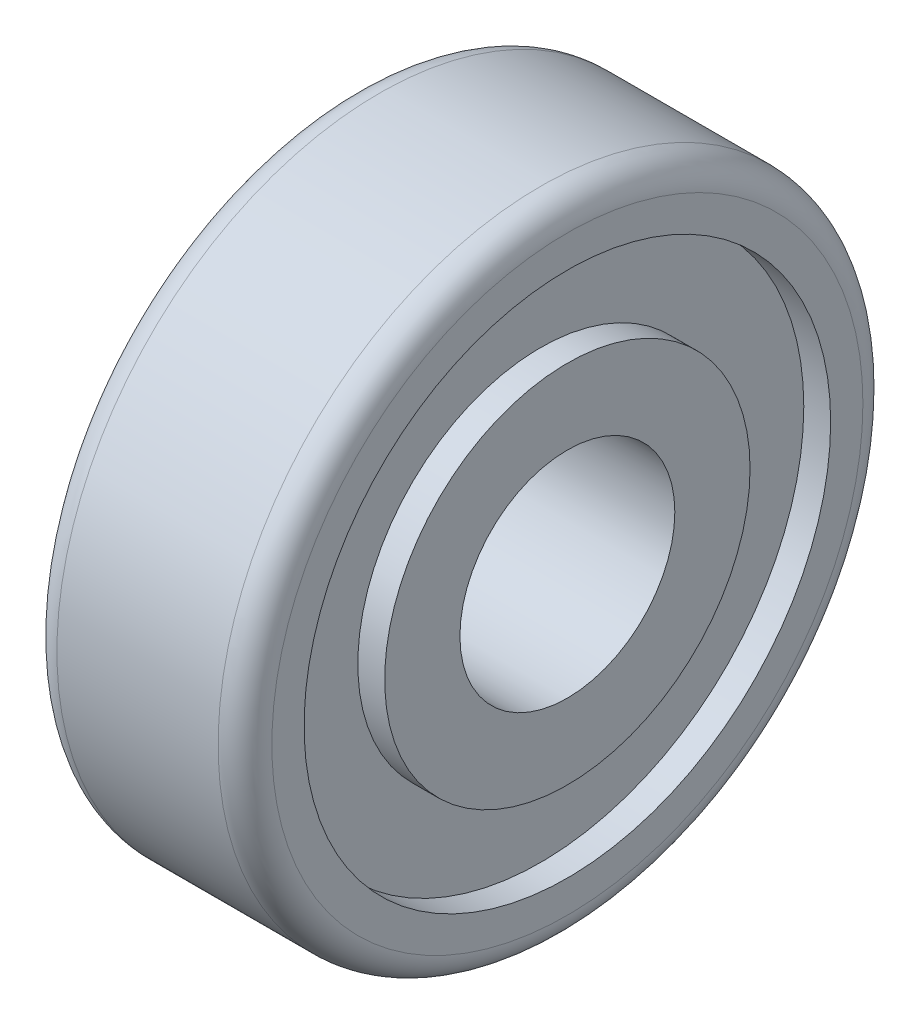
ISO-10303-21;
HEADER;
FILE_DESCRIPTION(('STEP AP214'),'2;1');
FILE_NAME('part.step','',(''),(''),'','','');
FILE_SCHEMA(('AUTOMOTIVE_DESIGN { 1 0 10303 214 1 1 1 1 }'));
ENDSEC;
DATA;
#1=APPLICATION_CONTEXT('core data for automotive mechanical design processes');
#2=APPLICATION_PROTOCOL_DEFINITION('international standard','automotive_design',2000,#1);
#3=PRODUCT_CONTEXT('',#1,'mechanical');
#4=PRODUCT('Part','Part','',(#3));
#5=PRODUCT_RELATED_PRODUCT_CATEGORY('part','',(#4));
#6=PRODUCT_DEFINITION_FORMATION('','',#4);
#7=PRODUCT_DEFINITION_CONTEXT('part definition',#1,'design');
#8=PRODUCT_DEFINITION('design','',#6,#7);
#9=PRODUCT_DEFINITION_SHAPE('','',#8);
#10=(LENGTH_UNIT() NAMED_UNIT(*) SI_UNIT(.MILLI.,.METRE.));
#11=(NAMED_UNIT(*) PLANE_ANGLE_UNIT() SI_UNIT($,.RADIAN.));
#12=(NAMED_UNIT(*) SI_UNIT($,.STERADIAN.) SOLID_ANGLE_UNIT());
#13=UNCERTAINTY_MEASURE_WITH_UNIT(LENGTH_MEASURE(1.E-05),#10,'distance_accuracy_value','');
#14=(GEOMETRIC_REPRESENTATION_CONTEXT(3) GLOBAL_UNCERTAINTY_ASSIGNED_CONTEXT((#13)) GLOBAL_UNIT_ASSIGNED_CONTEXT((#10,
#11,#12)) REPRESENTATION_CONTEXT('',''));
#15=CARTESIAN_POINT('',(0.,0.,0.));
#16=DIRECTION('',(0.,0.,1.));
#17=DIRECTION('',(1.,0.,0.));
#18=AXIS2_PLACEMENT_3D('',#15,#16,#17);
#19=CARTESIAN_POINT('',(0.,0.,0.));
#20=DIRECTION('',(1.,0.,0.));
#21=DIRECTION('',(0.,0.,-1.));
#22=AXIS2_PLACEMENT_3D('',#19,#20,#21);
#23=PLANE('',#22);
#24=CARTESIAN_POINT('',(0.,0.,0.));
#25=DIRECTION('',(1.,0.,0.));
#26=DIRECTION('',(0.,0.,-1.));
#27=AXIS2_PLACEMENT_3D('',#24,#25,#26);
#28=CIRCLE('',#27,2.);
#29=CARTESIAN_POINT('',(0.,0.,-2.));
#30=VERTEX_POINT('',#29);
#31=EDGE_CURVE('E52',#30,#30,#28,.T.);
#32=ORIENTED_EDGE('',*,*,#31,.T.);
#33=EDGE_LOOP('',(#32));
#34=FACE_BOUND('',#33,.T.);
#35=CARTESIAN_POINT('',(0.,0.,0.));
#36=DIRECTION('',(-1.,0.,0.));
#37=DIRECTION('',(0.,0.,1.));
#38=AXIS2_PLACEMENT_3D('',#35,#36,#37);
#39=CIRCLE('',#38,3.4);
#40=CARTESIAN_POINT('',(0.,0.,3.4));
#41=VERTEX_POINT('',#40);
#42=EDGE_CURVE('E76',#41,#41,#39,.T.);
#43=ORIENTED_EDGE('',*,*,#42,.T.);
#44=EDGE_LOOP('',(#43));
#45=FACE_BOUND('',#44,.T.);
#46=ADVANCED_FACE('F31',(#34,#45),#23,.F.);
#47=CARTESIAN_POINT('',(4.,0.,0.));
#48=DIRECTION('',(1.,0.,0.));
#49=DIRECTION('',(0.,0.,-1.));
#50=AXIS2_PLACEMENT_3D('',#47,#48,#49);
#51=PLANE('',#50);
#52=CARTESIAN_POINT('',(4.,0.,0.));
#53=DIRECTION('',(1.,0.,0.));
#54=DIRECTION('',(0.,0.,-1.));
#55=AXIS2_PLACEMENT_3D('',#52,#53,#54);
#56=CIRCLE('',#55,2.);
#57=CARTESIAN_POINT('',(4.,0.,-2.));
#58=VERTEX_POINT('',#57);
#59=EDGE_CURVE('E51',#58,#58,#56,.T.);
#60=ORIENTED_EDGE('',*,*,#59,.F.);
#61=EDGE_LOOP('',(#60));
#62=FACE_BOUND('',#61,.T.);
#63=CARTESIAN_POINT('',(4.,0.,0.));
#64=DIRECTION('',(1.,0.,0.));
#65=DIRECTION('',(0.,0.,-1.));
#66=AXIS2_PLACEMENT_3D('',#63,#64,#65);
#67=CIRCLE('',#66,3.4);
#68=CARTESIAN_POINT('',(4.,0.,-3.4));
#69=VERTEX_POINT('',#68);
#70=EDGE_CURVE('E64',#69,#69,#67,.T.);
#71=ORIENTED_EDGE('',*,*,#70,.T.);
#72=EDGE_LOOP('',(#71));
#73=FACE_BOUND('',#72,.T.);
#74=ADVANCED_FACE('F110',(#62,#73),#51,.T.);
#75=CARTESIAN_POINT('',(4.,0.,0.));
#76=DIRECTION('',(1.,0.,0.));
#77=DIRECTION('',(0.,0.,-1.));
#78=AXIS2_PLACEMENT_3D('',#75,#76,#77);
#79=CIRCLE('',#78,4.9);
#80=CARTESIAN_POINT('',(4.,0.,-4.9));
#81=VERTEX_POINT('',#80);
#82=EDGE_CURVE('E58',#81,#81,#79,.T.);
#83=ORIENTED_EDGE('',*,*,#82,.F.);
#84=EDGE_LOOP('',(#83));
#85=FACE_BOUND('',#84,.T.);
#86=CARTESIAN_POINT('',(4.,0.,0.));
#87=DIRECTION('',(1.,0.,0.));
#88=DIRECTION('',(0.,0.,-1.));
#89=AXIS2_PLACEMENT_3D('',#86,#87,#88);
#90=CIRCLE('',#89,5.5);
#91=CARTESIAN_POINT('',(4.,0.,-5.5));
#92=VERTEX_POINT('',#91);
#93=EDGE_CURVE('E10',#92,#92,#90,.T.);
#94=ORIENTED_EDGE('',*,*,#93,.T.);
#95=EDGE_LOOP('',(#94));
#96=FACE_BOUND('',#95,.T.);
#97=ADVANCED_FACE('F101',(#85,#96),#51,.T.);
#98=CARTESIAN_POINT('',(0.,0.,0.));
#99=DIRECTION('',(-1.,0.,0.));
#100=DIRECTION('',(0.,0.,1.));
#101=AXIS2_PLACEMENT_3D('',#98,#99,#100);
#102=CIRCLE('',#101,4.9);
#103=CARTESIAN_POINT('',(0.,0.,4.9));
#104=VERTEX_POINT('',#103);
#105=EDGE_CURVE('E70',#104,#104,#102,.T.);
#106=ORIENTED_EDGE('',*,*,#105,.F.);
#107=EDGE_LOOP('',(#106));
#108=FACE_BOUND('',#107,.T.);
#109=CARTESIAN_POINT('',(0.,0.,0.));
#110=DIRECTION('',(1.,0.,0.));
#111=DIRECTION('',(0.,0.,-1.));
#112=AXIS2_PLACEMENT_3D('',#109,#110,#111);
#113=CIRCLE('',#112,5.5);
#114=CARTESIAN_POINT('',(0.,0.,-5.5));
#115=VERTEX_POINT('',#114);
#116=EDGE_CURVE('E38',#115,#115,#113,.F.);
#117=ORIENTED_EDGE('',*,*,#116,.T.);
#118=EDGE_LOOP('',(#117));
#119=FACE_BOUND('',#118,.T.);
#120=ADVANCED_FACE('F98',(#108,#119),#23,.F.);
#121=CARTESIAN_POINT('',(4.,0.,0.));
#122=DIRECTION('',(-1.,0.,0.));
#123=DIRECTION('',(0.,0.,1.));
#124=AXIS2_PLACEMENT_3D('',#121,#122,#123);
#125=CYLINDRICAL_SURFACE('',#124,6.);
#126=CARTESIAN_POINT('',(0.5,0.,0.));
#127=DIRECTION('',(1.,0.,0.));
#128=DIRECTION('',(0.,0.,-1.));
#129=AXIS2_PLACEMENT_3D('',#126,#127,#128);
#130=CIRCLE('',#129,6.);
#131=CARTESIAN_POINT('',(0.5,0.,-6.));
#132=VERTEX_POINT('',#131);
#133=EDGE_CURVE('E42',#132,#132,#130,.T.);
#134=ORIENTED_EDGE('',*,*,#133,.T.);
#135=EDGE_LOOP('',(#134));
#136=FACE_BOUND('',#135,.T.);
#137=CARTESIAN_POINT('',(3.5,0.,0.));
#138=DIRECTION('',(1.,0.,0.));
#139=DIRECTION('',(0.,0.,-1.));
#140=AXIS2_PLACEMENT_3D('',#137,#138,#139);
#141=CIRCLE('',#140,6.);
#142=CARTESIAN_POINT('',(3.5,0.,-6.));
#143=VERTEX_POINT('',#142);
#144=EDGE_CURVE('E46',#143,#143,#141,.F.);
#145=ORIENTED_EDGE('',*,*,#144,.T.);
#146=EDGE_LOOP('',(#145));
#147=FACE_BOUND('',#146,.T.);
#148=ADVANCED_FACE('F100',(#136,#147),#125,.T.);
#149=CARTESIAN_POINT('',(4.,0.,0.));
#150=DIRECTION('',(-1.,0.,0.));
#151=DIRECTION('',(0.,0.,1.));
#152=AXIS2_PLACEMENT_3D('',#149,#150,#151);
#153=CYLINDRICAL_SURFACE('',#152,2.);
#154=ORIENTED_EDGE('',*,*,#59,.T.);
#155=EDGE_LOOP('',(#154));
#156=FACE_BOUND('',#155,.T.);
#157=ORIENTED_EDGE('',*,*,#31,.F.);
#158=EDGE_LOOP('',(#157));
#159=FACE_BOUND('',#158,.T.);
#160=ADVANCED_FACE('F107',(#156,#159),#153,.F.);
#161=CARTESIAN_POINT('',(0.5,0.,0.));
#162=DIRECTION('',(1.,0.,0.));
#163=DIRECTION('',(0.,0.,-1.));
#164=AXIS2_PLACEMENT_3D('',#161,#162,#163);
#165=TOROIDAL_SURFACE('',#164,5.5,0.5);
#166=ORIENTED_EDGE('',*,*,#116,.F.);
#167=EDGE_LOOP('',(#166));
#168=FACE_BOUND('',#167,.T.);
#169=ORIENTED_EDGE('',*,*,#133,.F.);
#170=EDGE_LOOP('',(#169));
#171=FACE_BOUND('',#170,.T.);
#172=ADVANCED_FACE('F139',(#168,#171),#165,.T.);
#173=CARTESIAN_POINT('',(3.5,0.,0.));
#174=DIRECTION('',(1.,0.,0.));
#175=DIRECTION('',(0.,0.,-1.));
#176=AXIS2_PLACEMENT_3D('',#173,#174,#175);
#177=TOROIDAL_SURFACE('',#176,5.5,0.5);
#178=ORIENTED_EDGE('',*,*,#144,.F.);
#179=EDGE_LOOP('',(#178));
#180=FACE_BOUND('',#179,.T.);
#181=ORIENTED_EDGE('',*,*,#93,.F.);
#182=EDGE_LOOP('',(#181));
#183=FACE_BOUND('',#182,.T.);
#184=ADVANCED_FACE('F33',(#180,#183),#177,.T.);
#185=CARTESIAN_POINT('',(3.5,0.,0.));
#186=DIRECTION('',(1.,0.,0.));
#187=DIRECTION('',(0.,0.,-1.));
#188=AXIS2_PLACEMENT_3D('',#185,#186,#187);
#189=CYLINDRICAL_SURFACE('',#188,4.9);
#190=CARTESIAN_POINT('',(3.5,0.,0.));
#191=DIRECTION('',(1.,0.,0.));
#192=DIRECTION('',(0.,0.,-1.));
#193=AXIS2_PLACEMENT_3D('',#190,#191,#192);
#194=CIRCLE('',#193,4.9);
#195=CARTESIAN_POINT('',(3.5,0.,-4.9));
#196=VERTEX_POINT('',#195);
#197=EDGE_CURVE('E55',#196,#196,#194,.T.);
#198=ORIENTED_EDGE('',*,*,#197,.F.);
#199=EDGE_LOOP('',(#198));
#200=FACE_BOUND('',#199,.T.);
#201=ORIENTED_EDGE('',*,*,#82,.T.);
#202=EDGE_LOOP('',(#201));
#203=FACE_BOUND('',#202,.T.);
#204=ADVANCED_FACE('F133',(#200,#203),#189,.F.);
#205=CARTESIAN_POINT('',(3.5,0.,0.));
#206=DIRECTION('',(1.,0.,0.));
#207=DIRECTION('',(0.,0.,-1.));
#208=AXIS2_PLACEMENT_3D('',#205,#206,#207);
#209=PLANE('',#208);
#210=CARTESIAN_POINT('',(3.5,0.,0.));
#211=DIRECTION('',(1.,0.,0.));
#212=DIRECTION('',(0.,0.,-1.));
#213=AXIS2_PLACEMENT_3D('',#210,#211,#212);
#214=CIRCLE('',#213,3.4);
#215=CARTESIAN_POINT('',(3.5,0.,-3.4));
#216=VERTEX_POINT('',#215);
#217=EDGE_CURVE('E61',#216,#216,#214,.T.);
#218=ORIENTED_EDGE('',*,*,#217,.F.);
#219=EDGE_LOOP('',(#218));
#220=FACE_BOUND('',#219,.T.);
#221=ORIENTED_EDGE('',*,*,#197,.T.);
#222=EDGE_LOOP('',(#221));
#223=FACE_BOUND('',#222,.T.);
#224=ADVANCED_FACE('F129',(#220,#223),#209,.T.);
#225=CARTESIAN_POINT('',(3.5,0.,0.));
#226=DIRECTION('',(1.,0.,0.));
#227=DIRECTION('',(0.,0.,-1.));
#228=AXIS2_PLACEMENT_3D('',#225,#226,#227);
#229=CYLINDRICAL_SURFACE('',#228,3.4);
#230=ORIENTED_EDGE('',*,*,#217,.T.);
#231=EDGE_LOOP('',(#230));
#232=FACE_BOUND('',#231,.T.);
#233=ORIENTED_EDGE('',*,*,#70,.F.);
#234=EDGE_LOOP('',(#233));
#235=FACE_BOUND('',#234,.T.);
#236=ADVANCED_FACE('F94',(#232,#235),#229,.T.);
#237=CARTESIAN_POINT('',(0.5,0.,0.));
#238=DIRECTION('',(-1.,0.,0.));
#239=DIRECTION('',(0.,0.,1.));
#240=AXIS2_PLACEMENT_3D('',#237,#238,#239);
#241=CYLINDRICAL_SURFACE('',#240,4.9);
#242=CARTESIAN_POINT('',(0.5,0.,0.));
#243=DIRECTION('',(-1.,0.,0.));
#244=DIRECTION('',(0.,0.,1.));
#245=AXIS2_PLACEMENT_3D('',#242,#243,#244);
#246=CIRCLE('',#245,4.9);
#247=CARTESIAN_POINT('',(0.5,0.,4.9));
#248=VERTEX_POINT('',#247);
#249=EDGE_CURVE('E67',#248,#248,#246,.T.);
#250=ORIENTED_EDGE('',*,*,#249,.F.);
#251=EDGE_LOOP('',(#250));
#252=FACE_BOUND('',#251,.T.);
#253=ORIENTED_EDGE('',*,*,#105,.T.);
#254=EDGE_LOOP('',(#253));
#255=FACE_BOUND('',#254,.T.);
#256=ADVANCED_FACE('F88',(#252,#255),#241,.F.);
#257=CARTESIAN_POINT('',(0.5,0.,0.));
#258=DIRECTION('',(-1.,0.,0.));
#259=DIRECTION('',(0.,0.,1.));
#260=AXIS2_PLACEMENT_3D('',#257,#258,#259);
#261=PLANE('',#260);
#262=CARTESIAN_POINT('',(0.5,0.,0.));
#263=DIRECTION('',(-1.,0.,0.));
#264=DIRECTION('',(0.,0.,1.));
#265=AXIS2_PLACEMENT_3D('',#262,#263,#264);
#266=CIRCLE('',#265,3.4);
#267=CARTESIAN_POINT('',(0.5,0.,3.4));
#268=VERTEX_POINT('',#267);
#269=EDGE_CURVE('E73',#268,#268,#266,.T.);
#270=ORIENTED_EDGE('',*,*,#269,.F.);
#271=EDGE_LOOP('',(#270));
#272=FACE_BOUND('',#271,.T.);
#273=ORIENTED_EDGE('',*,*,#249,.T.);
#274=EDGE_LOOP('',(#273));
#275=FACE_BOUND('',#274,.T.);
#276=ADVANCED_FACE('F85',(#272,#275),#261,.T.);
#277=CARTESIAN_POINT('',(0.5,0.,0.));
#278=DIRECTION('',(-1.,0.,0.));
#279=DIRECTION('',(0.,0.,1.));
#280=AXIS2_PLACEMENT_3D('',#277,#278,#279);
#281=CYLINDRICAL_SURFACE('',#280,3.4);
#282=ORIENTED_EDGE('',*,*,#269,.T.);
#283=EDGE_LOOP('',(#282));
#284=FACE_BOUND('',#283,.T.);
#285=ORIENTED_EDGE('',*,*,#42,.F.);
#286=EDGE_LOOP('',(#285));
#287=FACE_BOUND('',#286,.T.);
#288=ADVANCED_FACE('F82',(#284,#287),#281,.T.);
#289=CLOSED_SHELL('',(#46,#74,#97,#120,#148,#160,#172,#184,#204,#224,#236,#256,#276,#288));
#290=MANIFOLD_SOLID_BREP('B2',#289);
#291=ADVANCED_BREP_SHAPE_REPRESENTATION('',(#18,#290),#14);
#292=SHAPE_DEFINITION_REPRESENTATION(#9,#291);
ENDSEC;
END-ISO-10303-21;
